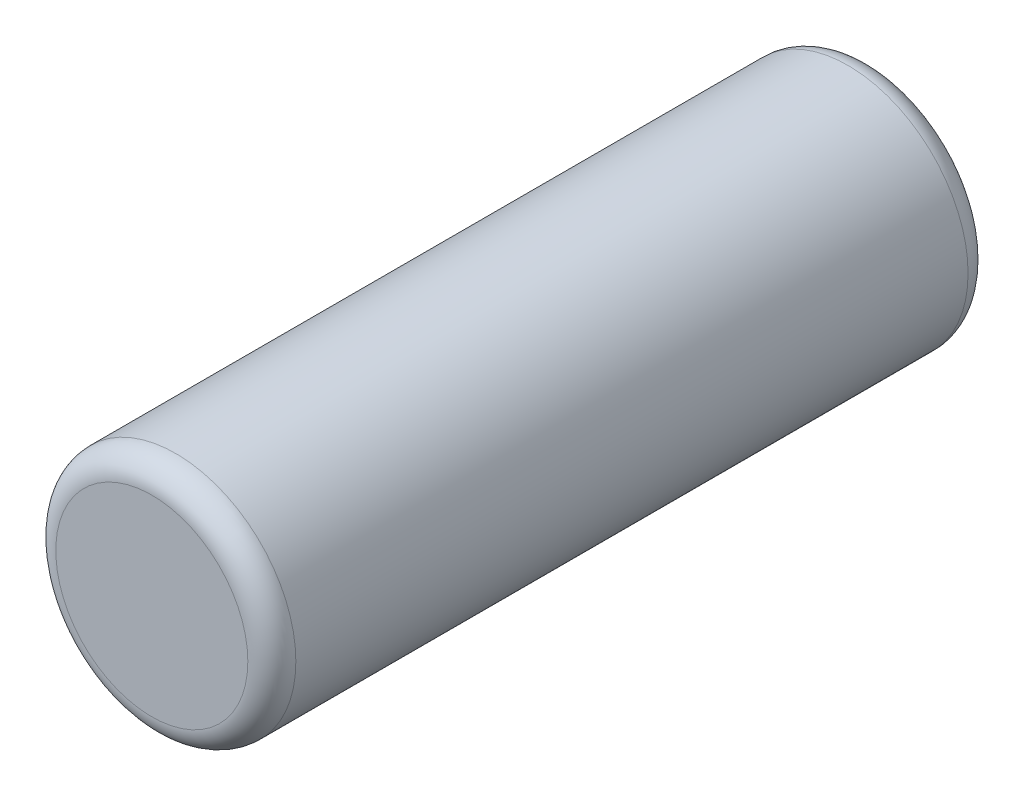
ISO-10303-21;
HEADER;
FILE_DESCRIPTION(('STEP AP214'),'2;1');
FILE_NAME('part.step','',(''),(''),'','','');
FILE_SCHEMA(('AUTOMOTIVE_DESIGN { 1 0 10303 214 1 1 1 1 }'));
ENDSEC;
DATA;
#1=APPLICATION_CONTEXT('core data for automotive mechanical design processes');
#2=APPLICATION_PROTOCOL_DEFINITION('international standard','automotive_design',2000,#1);
#3=PRODUCT_CONTEXT('',#1,'mechanical');
#4=PRODUCT('Part','Part','',(#3));
#5=PRODUCT_RELATED_PRODUCT_CATEGORY('part','',(#4));
#6=PRODUCT_DEFINITION_FORMATION('','',#4);
#7=PRODUCT_DEFINITION_CONTEXT('part definition',#1,'design');
#8=PRODUCT_DEFINITION('design','',#6,#7);
#9=PRODUCT_DEFINITION_SHAPE('','',#8);
#10=(LENGTH_UNIT() NAMED_UNIT(*) SI_UNIT(.MILLI.,.METRE.));
#11=(NAMED_UNIT(*) PLANE_ANGLE_UNIT() SI_UNIT($,.RADIAN.));
#12=(NAMED_UNIT(*) SI_UNIT($,.STERADIAN.) SOLID_ANGLE_UNIT());
#13=UNCERTAINTY_MEASURE_WITH_UNIT(LENGTH_MEASURE(1.E-05),#10,'distance_accuracy_value','');
#14=(GEOMETRIC_REPRESENTATION_CONTEXT(3) GLOBAL_UNCERTAINTY_ASSIGNED_CONTEXT((#13)) GLOBAL_UNIT_ASSIGNED_CONTEXT((#10,
#11,#12)) REPRESENTATION_CONTEXT('',''));
#15=CARTESIAN_POINT('',(0.,0.,0.));
#16=DIRECTION('',(0.,0.,1.));
#17=DIRECTION('',(1.,0.,0.));
#18=AXIS2_PLACEMENT_3D('',#15,#16,#17);
#19=CARTESIAN_POINT('',(0.,0.,15.));
#20=DIRECTION('',(0.,0.,-1.));
#21=DIRECTION('',(-1.,0.,0.));
#22=AXIS2_PLACEMENT_3D('',#19,#20,#21);
#23=CYLINDRICAL_SURFACE('',#22,2.5);
#24=CARTESIAN_POINT('',(0.,0.,0.5));
#25=DIRECTION('',(0.,0.,1.));
#26=DIRECTION('',(1.,0.,0.));
#27=AXIS2_PLACEMENT_3D('',#24,#25,#26);
#28=CIRCLE('',#27,2.5);
#29=CARTESIAN_POINT('',(2.5,0.,0.5));
#30=VERTEX_POINT('',#29);
#31=EDGE_CURVE('E42',#30,#30,#28,.T.);
#32=ORIENTED_EDGE('',*,*,#31,.T.);
#33=EDGE_LOOP('',(#32));
#34=FACE_BOUND('',#33,.T.);
#35=CARTESIAN_POINT('',(0.,0.,14.5));
#36=DIRECTION('',(0.,0.,1.));
#37=DIRECTION('',(1.,0.,0.));
#38=AXIS2_PLACEMENT_3D('',#35,#36,#37);
#39=CIRCLE('',#38,2.5);
#40=CARTESIAN_POINT('',(2.5,0.,14.5));
#41=VERTEX_POINT('',#40);
#42=EDGE_CURVE('E46',#41,#41,#39,.F.);
#43=ORIENTED_EDGE('',*,*,#42,.T.);
#44=EDGE_LOOP('',(#43));
#45=FACE_BOUND('',#44,.T.);
#46=ADVANCED_FACE('F31',(#34,#45),#23,.T.);
#47=CARTESIAN_POINT('',(0.,0.,15.));
#48=DIRECTION('',(0.,0.,1.));
#49=DIRECTION('',(1.,0.,0.));
#50=AXIS2_PLACEMENT_3D('',#47,#48,#49);
#51=PLANE('',#50);
#52=CARTESIAN_POINT('',(0.,0.,15.));
#53=DIRECTION('',(0.,0.,1.));
#54=DIRECTION('',(1.,0.,0.));
#55=AXIS2_PLACEMENT_3D('',#52,#53,#54);
#56=CIRCLE('',#55,2.);
#57=CARTESIAN_POINT('',(2.,0.,15.));
#58=VERTEX_POINT('',#57);
#59=EDGE_CURVE('E10',#58,#58,#56,.T.);
#60=ORIENTED_EDGE('',*,*,#59,.T.);
#61=EDGE_LOOP('',(#60));
#62=FACE_BOUND('',#61,.T.);
#63=ADVANCED_FACE('F62',(#62),#51,.T.);
#64=CARTESIAN_POINT('',(0.,0.,0.));
#65=DIRECTION('',(0.,0.,1.));
#66=DIRECTION('',(1.,0.,0.));
#67=AXIS2_PLACEMENT_3D('',#64,#65,#66);
#68=PLANE('',#67);
#69=CARTESIAN_POINT('',(0.,0.,0.));
#70=DIRECTION('',(0.,0.,1.));
#71=DIRECTION('',(1.,0.,0.));
#72=AXIS2_PLACEMENT_3D('',#69,#70,#71);
#73=CIRCLE('',#72,2.);
#74=CARTESIAN_POINT('',(2.,0.,0.));
#75=VERTEX_POINT('',#74);
#76=EDGE_CURVE('E38',#75,#75,#73,.F.);
#77=ORIENTED_EDGE('',*,*,#76,.T.);
#78=EDGE_LOOP('',(#77));
#79=FACE_BOUND('',#78,.T.);
#80=ADVANCED_FACE('F59',(#79),#68,.F.);
#81=CARTESIAN_POINT('',(0.,0.,0.5));
#82=DIRECTION('',(0.,0.,1.));
#83=DIRECTION('',(1.,0.,0.));
#84=AXIS2_PLACEMENT_3D('',#81,#82,#83);
#85=TOROIDAL_SURFACE('',#84,2.,0.5);
#86=ORIENTED_EDGE('',*,*,#76,.F.);
#87=EDGE_LOOP('',(#86));
#88=FACE_BOUND('',#87,.T.);
#89=ORIENTED_EDGE('',*,*,#31,.F.);
#90=EDGE_LOOP('',(#89));
#91=FACE_BOUND('',#90,.T.);
#92=ADVANCED_FACE('F55',(#88,#91),#85,.T.);
#93=CARTESIAN_POINT('',(0.,0.,14.5));
#94=DIRECTION('',(0.,0.,1.));
#95=DIRECTION('',(1.,0.,0.));
#96=AXIS2_PLACEMENT_3D('',#93,#94,#95);
#97=TOROIDAL_SURFACE('',#96,2.,0.5);
#98=ORIENTED_EDGE('',*,*,#42,.F.);
#99=EDGE_LOOP('',(#98));
#100=FACE_BOUND('',#99,.T.);
#101=ORIENTED_EDGE('',*,*,#59,.F.);
#102=EDGE_LOOP('',(#101));
#103=FACE_BOUND('',#102,.T.);
#104=ADVANCED_FACE('F33',(#100,#103),#97,.T.);
#105=CLOSED_SHELL('',(#46,#63,#80,#92,#104));
#106=MANIFOLD_SOLID_BREP('B2',#105);
#107=ADVANCED_BREP_SHAPE_REPRESENTATION('',(#18,#106),#14);
#108=SHAPE_DEFINITION_REPRESENTATION(#9,#107);
ENDSEC;
END-ISO-10303-21;
